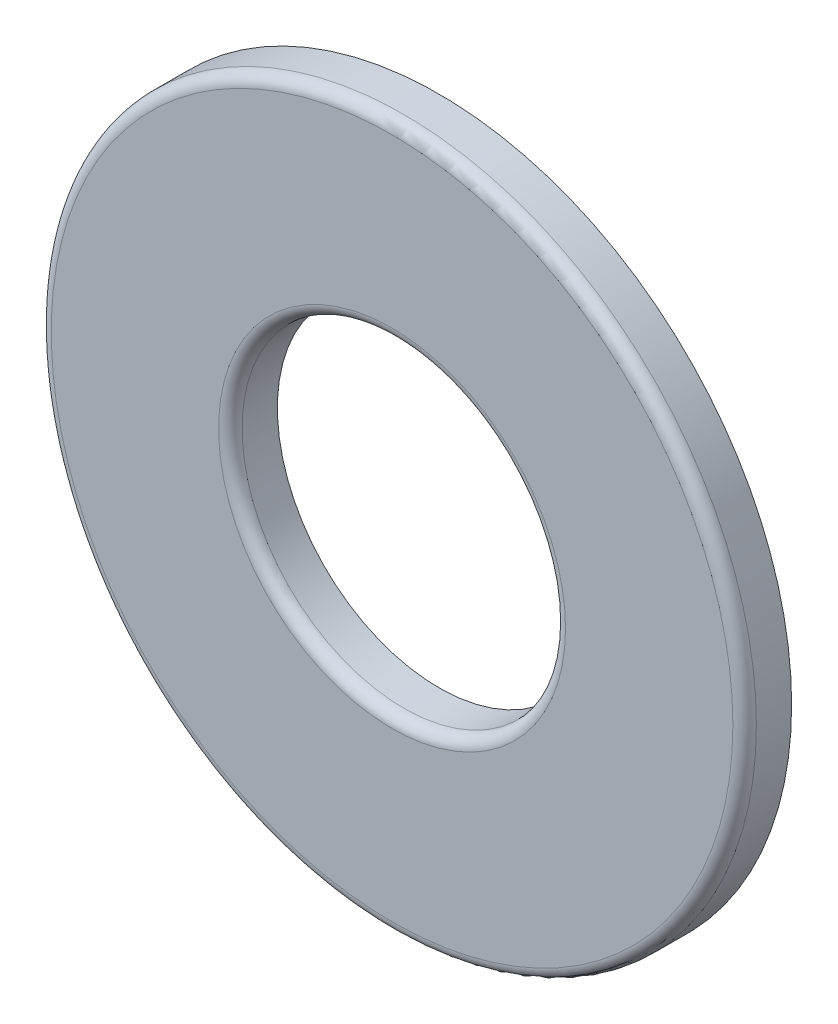
ISO-10303-21;
HEADER;
FILE_DESCRIPTION(('STEP AP214'),'2;1');
FILE_NAME('part.step','',(''),(''),'','','');
FILE_SCHEMA(('AUTOMOTIVE_DESIGN { 1 0 10303 214 1 1 1 1 }'));
ENDSEC;
DATA;
#1=APPLICATION_CONTEXT('core data for automotive mechanical design processes');
#2=APPLICATION_PROTOCOL_DEFINITION('international standard','automotive_design',2000,#1);
#3=PRODUCT_CONTEXT('',#1,'mechanical');
#4=PRODUCT('Part','Part','',(#3));
#5=PRODUCT_RELATED_PRODUCT_CATEGORY('part','',(#4));
#6=PRODUCT_DEFINITION_FORMATION('','',#4);
#7=PRODUCT_DEFINITION_CONTEXT('part definition',#1,'design');
#8=PRODUCT_DEFINITION('design','',#6,#7);
#9=PRODUCT_DEFINITION_SHAPE('','',#8);
#10=(LENGTH_UNIT() NAMED_UNIT(*) SI_UNIT(.MILLI.,.METRE.));
#11=(NAMED_UNIT(*) PLANE_ANGLE_UNIT() SI_UNIT($,.RADIAN.));
#12=(NAMED_UNIT(*) SI_UNIT($,.STERADIAN.) SOLID_ANGLE_UNIT());
#13=UNCERTAINTY_MEASURE_WITH_UNIT(LENGTH_MEASURE(1.E-05),#10,'distance_accuracy_value','');
#14=(GEOMETRIC_REPRESENTATION_CONTEXT(3) GLOBAL_UNCERTAINTY_ASSIGNED_CONTEXT((#13)) GLOBAL_UNIT_ASSIGNED_CONTEXT((#10,
#11,#12)) REPRESENTATION_CONTEXT('',''));
#15=CARTESIAN_POINT('',(0.,0.,0.));
#16=DIRECTION('',(0.,0.,1.));
#17=DIRECTION('',(1.,0.,0.));
#18=AXIS2_PLACEMENT_3D('',#15,#16,#17);
#19=CARTESIAN_POINT('',(0.,0.,0.634999999999998));
#20=DIRECTION('',(0.,0.,1.));
#21=DIRECTION('',(1.,0.,0.));
#22=AXIS2_PLACEMENT_3D('',#19,#20,#21);
#23=PLANE('',#22);
#24=CARTESIAN_POINT('',(0.,0.,0.634999999999998));
#25=DIRECTION('',(0.,0.,1.));
#26=DIRECTION('',(1.,0.,0.));
#27=AXIS2_PLACEMENT_3D('',#24,#25,#26);
#28=CIRCLE('',#27,9.2075);
#29=CARTESIAN_POINT('',(9.2075,0.,0.634999999999998));
#30=VERTEX_POINT('',#29);
#31=EDGE_CURVE('E50',#30,#30,#28,.T.);
#32=ORIENTED_EDGE('',*,*,#31,.T.);
#33=EDGE_LOOP('',(#32));
#34=FACE_BOUND('',#33,.T.);
#35=CARTESIAN_POINT('',(0.,0.,0.634999999999998));
#36=DIRECTION('',(0.,0.,1.));
#37=DIRECTION('',(1.,0.,0.));
#38=AXIS2_PLACEMENT_3D('',#35,#36,#37);
#39=CIRCLE('',#38,4.6863);
#40=CARTESIAN_POINT('',(4.6863,0.,0.634999999999998));
#41=VERTEX_POINT('',#40);
#42=EDGE_CURVE('E54',#41,#41,#39,.F.);
#43=ORIENTED_EDGE('',*,*,#42,.T.);
#44=EDGE_LOOP('',(#43));
#45=FACE_BOUND('',#44,.T.);
#46=ADVANCED_FACE('F39',(#34,#45),#23,.T.);
#47=CARTESIAN_POINT('',(0.,0.,0.634999999999998));
#48=DIRECTION('',(0.,0.,-1.));
#49=DIRECTION('',(-1.,0.,0.));
#50=AXIS2_PLACEMENT_3D('',#47,#48,#49);
#51=CYLINDRICAL_SURFACE('',#50,9.525);
#52=CARTESIAN_POINT('',(0.,0.,0.317499999999998));
#53=DIRECTION('',(0.,0.,1.));
#54=DIRECTION('',(1.,0.,0.));
#55=AXIS2_PLACEMENT_3D('',#52,#53,#54);
#56=CIRCLE('',#55,9.525);
#57=CARTESIAN_POINT('',(9.525,0.,0.317499999999998));
#58=VERTEX_POINT('',#57);
#59=EDGE_CURVE('E46',#58,#58,#56,.F.);
#60=ORIENTED_EDGE('',*,*,#59,.T.);
#61=EDGE_LOOP('',(#60));
#62=FACE_BOUND('',#61,.T.);
#63=CARTESIAN_POINT('',(0.,0.,-0.635000000000002));
#64=DIRECTION('',(0.,0.,1.));
#65=DIRECTION('',(1.,0.,0.));
#66=AXIS2_PLACEMENT_3D('',#63,#64,#65);
#67=CIRCLE('',#66,9.525);
#68=CARTESIAN_POINT('',(9.525,0.,-0.635000000000002));
#69=VERTEX_POINT('',#68);
#70=EDGE_CURVE('E59',#69,#69,#67,.T.);
#71=ORIENTED_EDGE('',*,*,#70,.T.);
#72=EDGE_LOOP('',(#71));
#73=FACE_BOUND('',#72,.T.);
#74=ADVANCED_FACE('F71',(#62,#73),#51,.T.);
#75=CARTESIAN_POINT('',(0.,0.,0.634999999999998));
#76=DIRECTION('',(0.,0.,-1.));
#77=DIRECTION('',(-1.,0.,0.));
#78=AXIS2_PLACEMENT_3D('',#75,#76,#77);
#79=CYLINDRICAL_SURFACE('',#78,4.3688);
#80=CARTESIAN_POINT('',(0.,0.,0.317499999999998));
#81=DIRECTION('',(0.,0.,1.));
#82=DIRECTION('',(1.,0.,0.));
#83=AXIS2_PLACEMENT_3D('',#80,#81,#82);
#84=CIRCLE('',#83,4.3688);
#85=CARTESIAN_POINT('',(4.3688,0.,0.317499999999998));
#86=VERTEX_POINT('',#85);
#87=EDGE_CURVE('E10',#86,#86,#84,.T.);
#88=ORIENTED_EDGE('',*,*,#87,.T.);
#89=EDGE_LOOP('',(#88));
#90=FACE_BOUND('',#89,.T.);
#91=CARTESIAN_POINT('',(0.,0.,-0.635000000000002));
#92=DIRECTION('',(0.,0.,1.));
#93=DIRECTION('',(1.,0.,0.));
#94=AXIS2_PLACEMENT_3D('',#91,#92,#93);
#95=CIRCLE('',#94,4.3688);
#96=CARTESIAN_POINT('',(4.3688,0.,-0.635000000000002));
#97=VERTEX_POINT('',#96);
#98=EDGE_CURVE('E62',#97,#97,#95,.T.);
#99=ORIENTED_EDGE('',*,*,#98,.F.);
#100=EDGE_LOOP('',(#99));
#101=FACE_BOUND('',#100,.T.);
#102=ADVANCED_FACE('F69',(#90,#101),#79,.F.);
#103=CARTESIAN_POINT('',(0.,0.,-0.635000000000002));
#104=DIRECTION('',(0.,0.,1.));
#105=DIRECTION('',(1.,0.,0.));
#106=AXIS2_PLACEMENT_3D('',#103,#104,#105);
#107=PLANE('',#106);
#108=ORIENTED_EDGE('',*,*,#98,.T.);
#109=EDGE_LOOP('',(#108));
#110=FACE_BOUND('',#109,.T.);
#111=ORIENTED_EDGE('',*,*,#70,.F.);
#112=EDGE_LOOP('',(#111));
#113=FACE_BOUND('',#112,.T.);
#114=ADVANCED_FACE('F66',(#110,#113),#107,.F.);
#115=CARTESIAN_POINT('',(0.,0.,0.317499999999998));
#116=DIRECTION('',(0.,0.,1.));
#117=DIRECTION('',(1.,0.,0.));
#118=AXIS2_PLACEMENT_3D('',#115,#116,#117);
#119=TOROIDAL_SURFACE('',#118,9.2075,0.3175);
#120=ORIENTED_EDGE('',*,*,#59,.F.);
#121=EDGE_LOOP('',(#120));
#122=FACE_BOUND('',#121,.T.);
#123=ORIENTED_EDGE('',*,*,#31,.F.);
#124=EDGE_LOOP('',(#123));
#125=FACE_BOUND('',#124,.T.);
#126=ADVANCED_FACE('F78',(#122,#125),#119,.T.);
#127=CARTESIAN_POINT('',(0.,0.,0.317499999999998));
#128=DIRECTION('',(0.,0.,1.));
#129=DIRECTION('',(1.,0.,0.));
#130=AXIS2_PLACEMENT_3D('',#127,#128,#129);
#131=TOROIDAL_SURFACE('',#130,4.6863,0.3175);
#132=ORIENTED_EDGE('',*,*,#42,.F.);
#133=EDGE_LOOP('',(#132));
#134=FACE_BOUND('',#133,.T.);
#135=ORIENTED_EDGE('',*,*,#87,.F.);
#136=EDGE_LOOP('',(#135));
#137=FACE_BOUND('',#136,.T.);
#138=ADVANCED_FACE('F41',(#134,#137),#131,.T.);
#139=CLOSED_SHELL('',(#46,#74,#102,#114,#126,#138));
#140=MANIFOLD_SOLID_BREP('B2',#139);
#141=ADVANCED_BREP_SHAPE_REPRESENTATION('',(#18,#140),#14);
#142=SHAPE_DEFINITION_REPRESENTATION(#9,#141);
ENDSEC;
END-ISO-10303-21;
